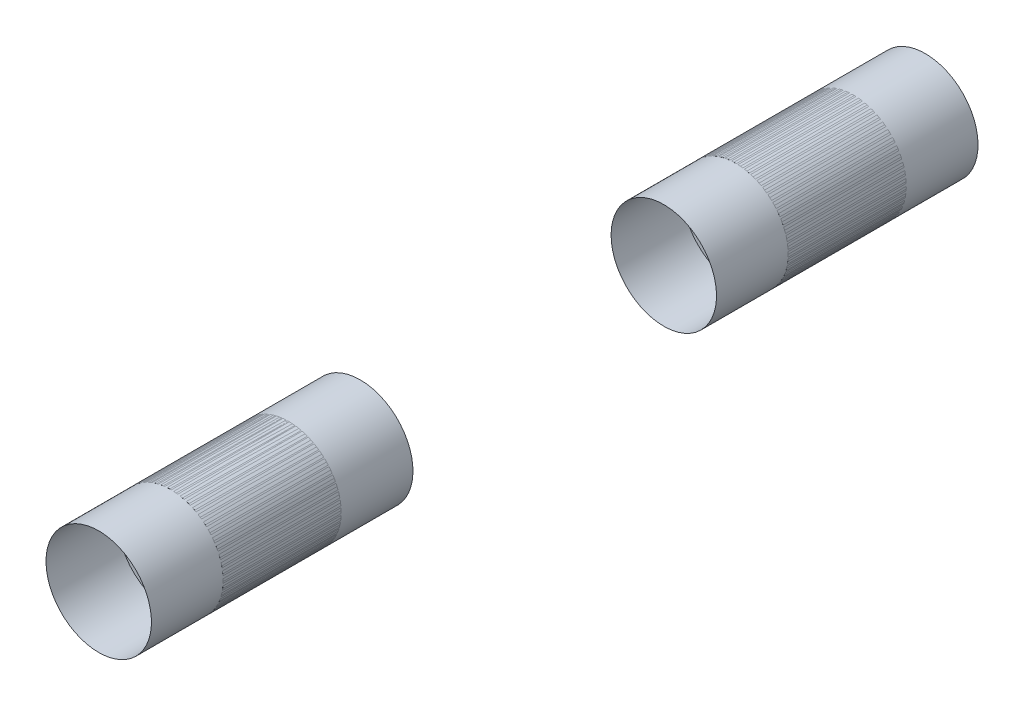
ISO-10303-21;
HEADER;
FILE_DESCRIPTION(('STEP AP214'),'2;1');
FILE_NAME('part.step','',(''),(''),'','','');
FILE_SCHEMA(('AUTOMOTIVE_DESIGN { 1 0 10303 214 1 1 1 1 }'));
ENDSEC;
DATA;
#1=APPLICATION_CONTEXT('core data for automotive mechanical design processes');
#2=APPLICATION_PROTOCOL_DEFINITION('international standard','automotive_design',2000,#1);
#3=PRODUCT_CONTEXT('',#1,'mechanical');
#4=PRODUCT('Part','Part','',(#3));
#5=PRODUCT_RELATED_PRODUCT_CATEGORY('part','',(#4));
#6=PRODUCT_DEFINITION_FORMATION('','',#4);
#7=PRODUCT_DEFINITION_CONTEXT('part definition',#1,'design');
#8=PRODUCT_DEFINITION('design','',#6,#7);
#9=PRODUCT_DEFINITION_SHAPE('','',#8);
#10=(LENGTH_UNIT() NAMED_UNIT(*) SI_UNIT(.MILLI.,.METRE.));
#11=(NAMED_UNIT(*) PLANE_ANGLE_UNIT() SI_UNIT($,.RADIAN.));
#12=(NAMED_UNIT(*) SI_UNIT($,.STERADIAN.) SOLID_ANGLE_UNIT());
#13=UNCERTAINTY_MEASURE_WITH_UNIT(LENGTH_MEASURE(1.E-05),#10,'distance_accuracy_value','');
#14=(GEOMETRIC_REPRESENTATION_CONTEXT(3) GLOBAL_UNCERTAINTY_ASSIGNED_CONTEXT((#13)) GLOBAL_UNIT_ASSIGNED_CONTEXT((#10,
#11,#12)) REPRESENTATION_CONTEXT('',''));
#15=CARTESIAN_POINT('',(0.,0.,0.));
#16=DIRECTION('',(0.,0.,1.));
#17=DIRECTION('',(1.,0.,0.));
#18=AXIS2_PLACEMENT_3D('',#15,#16,#17);
#19=CARTESIAN_POINT('',(2.56208615170422E-11,-3.28603596122305E-12,-40.8205122421979));
#20=DIRECTION('',(0.,0.,1.));
#21=DIRECTION('',(0.,-1.,0.));
#22=AXIS2_PLACEMENT_3D('',#19,#20,#21);
#23=CYLINDRICAL_SURFACE('',#22,6.35000000002108);
#24=CARTESIAN_POINT('',(2.56208615170422E-11,-3.25087179398054E-12,-8.64067708659198));
#25=DIRECTION('',(0.,0.,-1.));
#26=DIRECTION('',(0.,1.,0.));
#27=AXIS2_PLACEMENT_3D('',#24,#25,#26);
#28=CIRCLE('',#27,6.35000000002108);
#29=CARTESIAN_POINT('',(2.56208615170422E-11,6.35000000001783,-8.64067708659198));
#30=VERTEX_POINT('',#29);
#31=EDGE_CURVE('E53',#30,#30,#28,.T.);
#32=ORIENTED_EDGE('',*,*,#31,.T.);
#33=EDGE_LOOP('',(#32));
#34=FACE_BOUND('',#33,.T.);
#35=CARTESIAN_POINT('',(2.56208615170422E-11,-3.26640980548944E-12,-22.86));
#36=DIRECTION('',(0.,0.,-1.));
#37=DIRECTION('',(0.,1.,0.));
#38=AXIS2_PLACEMENT_3D('',#35,#36,#37);
#39=CIRCLE('',#38,6.35000000002108);
#40=CARTESIAN_POINT('',(2.56208615170422E-11,6.35000000001781,-22.86));
#41=VERTEX_POINT('',#40);
#42=EDGE_CURVE('E11',#41,#41,#39,.T.);
#43=ORIENTED_EDGE('',*,*,#42,.F.);
#44=EDGE_LOOP('',(#43));
#45=FACE_BOUND('',#44,.T.);
#46=ADVANCED_FACE('F46',(#34,#45),#23,.T.);
#47=CARTESIAN_POINT('',(2.56208615170422E-11,-3.25087179398054E-12,-8.64067708659198));
#48=DIRECTION('',(0.,0.,-1.));
#49=DIRECTION('',(0.,1.,0.));
#50=AXIS2_PLACEMENT_3D('',#47,#48,#49);
#51=PLANE('',#50);
#52=ORIENTED_EDGE('',*,*,#31,.F.);
#53=EDGE_LOOP('',(#52));
#54=FACE_BOUND('',#53,.T.);
#55=ADVANCED_FACE('F61',(#54),#51,.F.);
#56=CARTESIAN_POINT('',(0.,0.,-22.86));
#57=DIRECTION('',(0.,0.,-1.));
#58=DIRECTION('',(0.,1.,0.));
#59=AXIS2_PLACEMENT_3D('',#56,#57,#58);
#60=PLANE('',#59);
#61=ORIENTED_EDGE('',*,*,#42,.T.);
#62=EDGE_LOOP('',(#61));
#63=FACE_BOUND('',#62,.T.);
#64=ADVANCED_FACE('F48',(#63),#60,.T.);
#65=CLOSED_SHELL('',(#46,#55,#64));
#66=MANIFOLD_SOLID_BREP('B2',#65);
#67=CARTESIAN_POINT('',(-8.84256666303471E-12,0.,45.207322913408));
#68=DIRECTION('',(0.,0.,-1.));
#69=DIRECTION('',(0.,1.,0.));
#70=AXIS2_PLACEMENT_3D('',#67,#68,#69);
#71=PLANE('',#70);
#72=CARTESIAN_POINT('',(0.,2.4980018054066E-13,45.207322913408));
#73=DIRECTION('',(0.,0.,-1.));
#74=DIRECTION('',(0.,1.,0.));
#75=AXIS2_PLACEMENT_3D('',#72,#73,#74);
#76=CIRCLE('',#75,6.35000000000003);
#77=CARTESIAN_POINT('',(0.,6.35000000000028,45.207322913408));
#78=VERTEX_POINT('',#77);
#79=EDGE_CURVE('E45',#78,#78,#76,.F.);
#80=ORIENTED_EDGE('',*,*,#79,.F.);
#81=EDGE_LOOP('',(#80));
#82=FACE_BOUND('',#81,.T.);
#83=ADVANCED_FACE('F95',(#82),#71,.T.);
#84=CARTESIAN_POINT('',(0.,2.4980018054066E-13,59.4266458266656));
#85=DIRECTION('',(0.,0.,1.));
#86=DIRECTION('',(1.,0.,0.));
#87=AXIS2_PLACEMENT_3D('',#84,#85,#86);
#88=PLANE('',#87);
#89=CARTESIAN_POINT('',(0.,2.4980018054066E-13,59.4266458266656));
#90=DIRECTION('',(0.,0.,1.));
#91=DIRECTION('',(1.,0.,0.));
#92=AXIS2_PLACEMENT_3D('',#89,#90,#91);
#93=CIRCLE('',#92,6.35000000000003);
#94=CARTESIAN_POINT('',(6.34999999999997,2.4980018054066E-13,59.4266458266656));
#95=VERTEX_POINT('',#94);
#96=EDGE_CURVE('E101',#95,#95,#93,.T.);
#97=ORIENTED_EDGE('',*,*,#96,.T.);
#98=EDGE_LOOP('',(#97));
#99=FACE_BOUND('',#98,.T.);
#100=ADVANCED_FACE('F107',(#99),#88,.T.);
#101=CARTESIAN_POINT('',(0.,2.4980018054066E-13,27.2468106712696));
#102=DIRECTION('',(0.,0.,1.));
#103=DIRECTION('',(1.,0.,0.));
#104=AXIS2_PLACEMENT_3D('',#101,#102,#103);
#105=CYLINDRICAL_SURFACE('',#104,6.35000000000003);
#106=ORIENTED_EDGE('',*,*,#96,.F.);
#107=EDGE_LOOP('',(#106));
#108=FACE_BOUND('',#107,.T.);
#109=ORIENTED_EDGE('',*,*,#79,.T.);
#110=EDGE_LOOP('',(#109));
#111=FACE_BOUND('',#110,.T.);
#112=ADVANCED_FACE('F109',(#108,#111),#105,.T.);
#113=CLOSED_SHELL('',(#83,#100,#112));
#114=MANIFOLD_SOLID_BREP('B6',#113);
#115=CARTESIAN_POINT('',(0.,2.35922392732846E-13,47.9966458266657));
#116=DIRECTION('',(0.,0.,1.));
#117=DIRECTION('',(0.,1.,0.));
#118=AXIS2_PLACEMENT_3D('',#115,#116,#117);
#119=CYLINDRICAL_SURFACE('',#118,6.35);
#120=CARTESIAN_POINT('',(0.,2.4980018054066E-13,59.4266458266657));
#121=DIRECTION('',(0.,0.,1.));
#122=DIRECTION('',(0.,1.,0.));
#123=AXIS2_PLACEMENT_3D('',#120,#121,#122);
#124=CIRCLE('',#123,6.35);
#125=CARTESIAN_POINT('',(0.,6.35000000000025,59.4266458266656));
#126=VERTEX_POINT('',#125);
#127=EDGE_CURVE('E148',#126,#126,#124,.T.);
#128=ORIENTED_EDGE('',*,*,#127,.T.);
#129=EDGE_LOOP('',(#128));
#130=FACE_BOUND('',#129,.T.);
#131=CARTESIAN_POINT('',(0.,2.28983498828939E-13,36.5666458266657));
#132=DIRECTION('',(0.,0.,1.));
#133=DIRECTION('',(0.,1.,0.));
#134=AXIS2_PLACEMENT_3D('',#131,#132,#133);
#135=CIRCLE('',#134,6.35);
#136=CARTESIAN_POINT('',(0.,6.35000000000023,36.5666458266656));
#137=VERTEX_POINT('',#136);
#138=EDGE_CURVE('E94',#137,#137,#135,.T.);
#139=ORIENTED_EDGE('',*,*,#138,.F.);
#140=EDGE_LOOP('',(#139));
#141=FACE_BOUND('',#140,.T.);
#142=ADVANCED_FACE('F144',(#130,#141),#119,.F.);
#143=OPEN_SHELL('',(#142));
#144=SHELL_BASED_SURFACE_MODEL('B40',(#143));
#145=CARTESIAN_POINT('',(2.78541968620203E-11,-3.25781068788444E-12,-20.070677086592));
#146=DIRECTION('',(-1.95392418633252E-13,0.,1.));
#147=DIRECTION('',(0.,-1.,0.));
#148=AXIS2_PLACEMENT_3D('',#145,#146,#147);
#149=CYLINDRICAL_SURFACE('',#148,6.35);
#150=CARTESIAN_POINT('',(3.00875322069983E-11,-3.2682190287403E-12,-31.500677086592));
#151=DIRECTION('',(-1.95392418633252E-13,0.,1.));
#152=DIRECTION('',(0.,-1.,0.));
#153=AXIS2_PLACEMENT_3D('',#150,#151,#152);
#154=CIRCLE('',#153,6.35);
#155=CARTESIAN_POINT('',(3.00920526650096E-11,-6.35000000000327,-31.500677086592));
#156=VERTEX_POINT('',#155);
#157=EDGE_CURVE('E143',#156,#156,#154,.T.);
#158=ORIENTED_EDGE('',*,*,#157,.F.);
#159=EDGE_LOOP('',(#158));
#160=FACE_BOUND('',#159,.T.);
#161=CARTESIAN_POINT('',(2.56208615170422E-11,-3.25087179398054E-12,-8.64067708659198));
#162=DIRECTION('',(-1.95392418633252E-13,0.,1.));
#163=DIRECTION('',(0.,-1.,0.));
#164=AXIS2_PLACEMENT_3D('',#161,#162,#163);
#165=CIRCLE('',#164,6.35);
#166=CARTESIAN_POINT('',(2.56253819750535E-11,-6.35000000000325,-8.64067708659197));
#167=VERTEX_POINT('',#166);
#168=EDGE_CURVE('E180',#167,#167,#165,.F.);
#169=ORIENTED_EDGE('',*,*,#168,.F.);
#170=EDGE_LOOP('',(#169));
#171=FACE_BOUND('',#170,.T.);
#172=ADVANCED_FACE('F176',(#160,#171),#149,.F.);
#173=OPEN_SHELL('',(#172));
#174=SHELL_BASED_SURFACE_MODEL('B89',(#173));
#175=CARTESIAN_POINT('',(1.2868573183335E-11,-3.20923843055709E-12,56.637322913408));
#176=DIRECTION('',(1.95614463238177E-13,0.,-1.));
#177=DIRECTION('',(-1.,0.,-1.95669974389409E-13));
#178=AXIS2_PLACEMENT_3D('',#175,#176,#177);
#179=CYLINDRICAL_SURFACE('',#178,6.35);
#180=CARTESIAN_POINT('',(1.06326998685227E-11,-3.19883008970123E-12,68.067322913408));
#181=DIRECTION('',(1.95614463238177E-13,0.,-1.));
#182=DIRECTION('',(-1.,0.,-1.95669974389409E-13));
#183=AXIS2_PLACEMENT_3D('',#180,#181,#182);
#184=CIRCLE('',#183,6.35);
#185=CARTESIAN_POINT('',(-6.34999999998937,-3.20335054771251E-12,68.0673229134068));
#186=VERTEX_POINT('',#185);
#187=EDGE_CURVE('E213',#186,#186,#184,.T.);
#188=ORIENTED_EDGE('',*,*,#187,.F.);
#189=EDGE_LOOP('',(#188));
#190=FACE_BOUND('',#189,.T.);
#191=CARTESIAN_POINT('',(1.51044464981474E-11,-3.216177324461E-12,45.207322913408));
#192=DIRECTION('',(1.95614463238177E-13,0.,-1.));
#193=DIRECTION('',(-1.,0.,-1.95669974389409E-13));
#194=AXIS2_PLACEMENT_3D('',#191,#192,#193);
#195=CIRCLE('',#194,6.35);
#196=CARTESIAN_POINT('',(-6.3499999999849,-3.22069778247227E-12,45.2073229134068));
#197=VERTEX_POINT('',#196);
#198=EDGE_CURVE('E175',#197,#197,#195,.F.);
#199=ORIENTED_EDGE('',*,*,#198,.F.);
#200=EDGE_LOOP('',(#199));
#201=FACE_BOUND('',#200,.T.);
#202=ADVANCED_FACE('F209',(#190,#201),#179,.F.);
#203=OPEN_SHELL('',(#202));
#204=SHELL_BASED_SURFACE_MODEL('B138',(#203));
#205=CARTESIAN_POINT('',(0.,0.,-11.43));
#206=DIRECTION('',(0.,0.,-1.));
#207=DIRECTION('',(-1.,0.,0.));
#208=AXIS2_PLACEMENT_3D('',#205,#206,#207);
#209=CYLINDRICAL_SURFACE('',#208,6.35);
#210=CARTESIAN_POINT('',(0.,0.,0.));
#211=DIRECTION('',(0.,0.,-1.));
#212=DIRECTION('',(-1.,0.,0.));
#213=AXIS2_PLACEMENT_3D('',#210,#211,#212);
#214=CIRCLE('',#213,6.35);
#215=CARTESIAN_POINT('',(-6.35,0.,0.));
#216=VERTEX_POINT('',#215);
#217=EDGE_CURVE('E240',#216,#216,#214,.T.);
#218=ORIENTED_EDGE('',*,*,#217,.F.);
#219=EDGE_LOOP('',(#218));
#220=FACE_BOUND('',#219,.T.);
#221=CARTESIAN_POINT('',(0.,0.,-22.86));
#222=DIRECTION('',(0.,0.,-1.));
#223=DIRECTION('',(-1.,0.,0.));
#224=AXIS2_PLACEMENT_3D('',#221,#222,#223);
#225=CIRCLE('',#224,6.35);
#226=CARTESIAN_POINT('',(-6.35,0.,-22.86));
#227=VERTEX_POINT('',#226);
#228=EDGE_CURVE('E208',#227,#227,#225,.F.);
#229=ORIENTED_EDGE('',*,*,#228,.F.);
#230=EDGE_LOOP('',(#229));
#231=FACE_BOUND('',#230,.T.);
#232=ADVANCED_FACE('F236',(#220,#231),#209,.F.);
#233=OPEN_SHELL('',(#232));
#234=SHELL_BASED_SURFACE_MODEL('B170',(#233));
#235=ADVANCED_BREP_SHAPE_REPRESENTATION('',(#18,#66,#114),#14);
#236=MANIFOLD_SURFACE_SHAPE_REPRESENTATION('',(#18,#144,#174,#204,#234),#14);
#237=SHAPE_REPRESENTATION('',(#18),#14);
#238=SHAPE_DEFINITION_REPRESENTATION(#9,#237);
#239=SHAPE_REPRESENTATION_RELATIONSHIP('','',#237,#235);
#240=SHAPE_REPRESENTATION_RELATIONSHIP('','',#237,#236);
ENDSEC;
END-ISO-10303-21;
